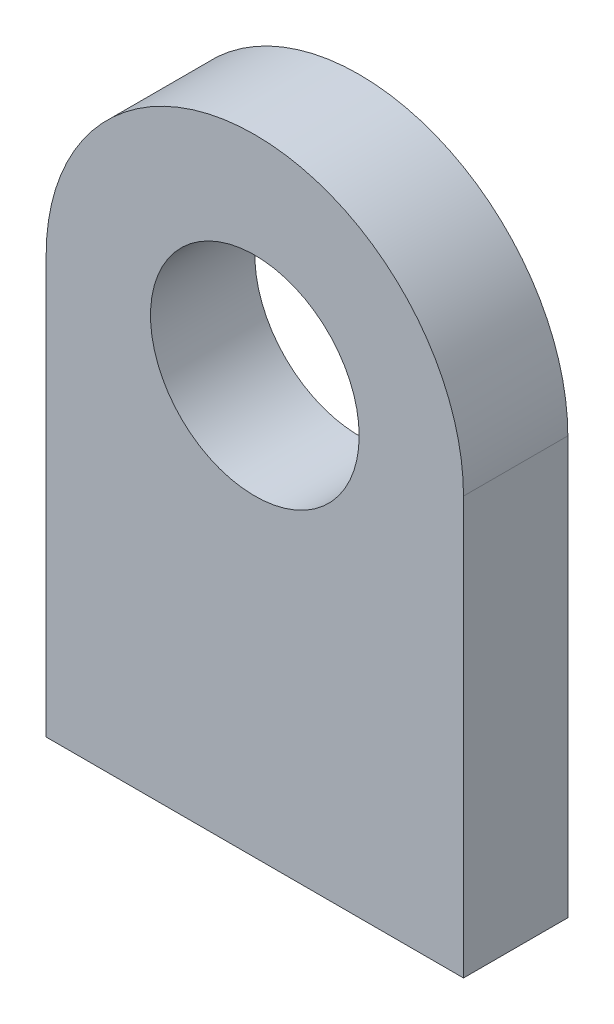
ISO-10303-21;
HEADER;
FILE_DESCRIPTION(('STEP AP214'),'2;1');
FILE_NAME('part.step','',(''),(''),'','','');
FILE_SCHEMA(('AUTOMOTIVE_DESIGN { 1 0 10303 214 1 1 1 1 }'));
ENDSEC;
DATA;
#1=APPLICATION_CONTEXT('core data for automotive mechanical design processes');
#2=APPLICATION_PROTOCOL_DEFINITION('international standard','automotive_design',2000,#1);
#3=PRODUCT_CONTEXT('',#1,'mechanical');
#4=PRODUCT('Part','Part','',(#3));
#5=PRODUCT_RELATED_PRODUCT_CATEGORY('part','',(#4));
#6=PRODUCT_DEFINITION_FORMATION('','',#4);
#7=PRODUCT_DEFINITION_CONTEXT('part definition',#1,'design');
#8=PRODUCT_DEFINITION('design','',#6,#7);
#9=PRODUCT_DEFINITION_SHAPE('','',#8);
#10=(LENGTH_UNIT() NAMED_UNIT(*) SI_UNIT(.MILLI.,.METRE.));
#11=(NAMED_UNIT(*) PLANE_ANGLE_UNIT() SI_UNIT($,.RADIAN.));
#12=(NAMED_UNIT(*) SI_UNIT($,.STERADIAN.) SOLID_ANGLE_UNIT());
#13=UNCERTAINTY_MEASURE_WITH_UNIT(LENGTH_MEASURE(1.E-05),#10,'distance_accuracy_value','');
#14=(GEOMETRIC_REPRESENTATION_CONTEXT(3) GLOBAL_UNCERTAINTY_ASSIGNED_CONTEXT((#13)) GLOBAL_UNIT_ASSIGNED_CONTEXT((#10,
#11,#12)) REPRESENTATION_CONTEXT('',''));
#15=CARTESIAN_POINT('',(0.,0.,0.));
#16=DIRECTION('',(0.,0.,1.));
#17=DIRECTION('',(1.,0.,0.));
#18=AXIS2_PLACEMENT_3D('',#15,#16,#17);
#19=CARTESIAN_POINT('',(0.,6.35,3.175));
#20=DIRECTION('',(0.,0.,-1.));
#21=DIRECTION('',(-1.,0.,0.));
#22=AXIS2_PLACEMENT_3D('',#19,#20,#21);
#23=PLANE('',#22);
#24=CARTESIAN_POINT('',(0.,6.35,3.175));
#25=DIRECTION('',(0.,0.,1.));
#26=DIRECTION('',(-1.,0.,0.));
#27=AXIS2_PLACEMENT_3D('',#24,#25,#26);
#28=CIRCLE('',#27,6.35);
#29=CARTESIAN_POINT('',(6.35,6.35,3.175));
#30=VERTEX_POINT('',#29);
#31=CARTESIAN_POINT('',(-6.35,6.35,3.175));
#32=VERTEX_POINT('',#31);
#33=EDGE_CURVE('E85',#30,#32,#28,.T.);
#34=ORIENTED_EDGE('',*,*,#33,.T.);
#35=DIRECTION('',(0.,-1.,0.));
#36=VECTOR('',#35,1.);
#37=CARTESIAN_POINT('',(-6.35,-6.35,3.175));
#38=LINE('',#37,#36);
#39=CARTESIAN_POINT('',(-6.35,-6.35,3.175));
#40=VERTEX_POINT('',#39);
#41=EDGE_CURVE('E80',#32,#40,#38,.T.);
#42=ORIENTED_EDGE('',*,*,#41,.T.);
#43=DIRECTION('',(1.,0.,0.));
#44=VECTOR('',#43,1.);
#45=CARTESIAN_POINT('',(6.35,-6.35,3.175));
#46=LINE('',#45,#44);
#47=CARTESIAN_POINT('',(6.35,-6.35,3.175));
#48=VERTEX_POINT('',#47);
#49=EDGE_CURVE('E83',#40,#48,#46,.T.);
#50=ORIENTED_EDGE('',*,*,#49,.T.);
#51=DIRECTION('',(0.,1.,0.));
#52=VECTOR('',#51,1.);
#53=CARTESIAN_POINT('',(6.35,-6.35,3.175));
#54=LINE('',#53,#52);
#55=EDGE_CURVE('E50',#48,#30,#54,.T.);
#56=ORIENTED_EDGE('',*,*,#55,.T.);
#57=EDGE_LOOP('',(#34,#42,#50,#56));
#58=FACE_BOUND('',#57,.T.);
#59=CARTESIAN_POINT('',(0.,6.35,3.175));
#60=DIRECTION('',(0.,0.,1.));
#61=DIRECTION('',(1.,0.,0.));
#62=AXIS2_PLACEMENT_3D('',#59,#60,#61);
#63=CIRCLE('',#62,3.175);
#64=CARTESIAN_POINT('',(3.175,6.35,3.175));
#65=VERTEX_POINT('',#64);
#66=EDGE_CURVE('E100',#65,#65,#63,.T.);
#67=ORIENTED_EDGE('',*,*,#66,.F.);
#68=EDGE_LOOP('',(#67));
#69=FACE_BOUND('',#68,.T.);
#70=ADVANCED_FACE('F33',(#58,#69),#23,.F.);
#71=CARTESIAN_POINT('',(0.,6.35,0.));
#72=DIRECTION('',(0.,0.,-1.));
#73=DIRECTION('',(-1.,0.,0.));
#74=AXIS2_PLACEMENT_3D('',#71,#72,#73);
#75=PLANE('',#74);
#76=CARTESIAN_POINT('',(0.,6.35,0.));
#77=DIRECTION('',(0.,0.,1.));
#78=DIRECTION('',(-1.,0.,0.));
#79=AXIS2_PLACEMENT_3D('',#76,#77,#78);
#80=CIRCLE('',#79,6.35);
#81=CARTESIAN_POINT('',(6.35,6.35,0.));
#82=VERTEX_POINT('',#81);
#83=CARTESIAN_POINT('',(-6.35,6.35,0.));
#84=VERTEX_POINT('',#83);
#85=EDGE_CURVE('E97',#82,#84,#80,.T.);
#86=ORIENTED_EDGE('',*,*,#85,.F.);
#87=DIRECTION('',(0.,1.,0.));
#88=VECTOR('',#87,1.);
#89=CARTESIAN_POINT('',(6.35,-6.35,0.));
#90=LINE('',#89,#88);
#91=CARTESIAN_POINT('',(6.35,-6.35,0.));
#92=VERTEX_POINT('',#91);
#93=EDGE_CURVE('E73',#92,#82,#90,.T.);
#94=ORIENTED_EDGE('',*,*,#93,.F.);
#95=DIRECTION('',(1.,0.,0.));
#96=VECTOR('',#95,1.);
#97=CARTESIAN_POINT('',(6.35,-6.35,0.));
#98=LINE('',#97,#96);
#99=CARTESIAN_POINT('',(-6.35,-6.35,0.));
#100=VERTEX_POINT('',#99);
#101=EDGE_CURVE('E67',#100,#92,#98,.T.);
#102=ORIENTED_EDGE('',*,*,#101,.F.);
#103=DIRECTION('',(0.,-1.,0.));
#104=VECTOR('',#103,1.);
#105=CARTESIAN_POINT('',(-6.35,-6.35,0.));
#106=LINE('',#105,#104);
#107=EDGE_CURVE('E89',#84,#100,#106,.T.);
#108=ORIENTED_EDGE('',*,*,#107,.F.);
#109=EDGE_LOOP('',(#86,#94,#102,#108));
#110=FACE_BOUND('',#109,.T.);
#111=CARTESIAN_POINT('',(0.,6.35,0.));
#112=DIRECTION('',(0.,0.,1.));
#113=DIRECTION('',(1.,0.,0.));
#114=AXIS2_PLACEMENT_3D('',#111,#112,#113);
#115=CIRCLE('',#114,3.175);
#116=CARTESIAN_POINT('',(3.175,6.35,0.));
#117=VERTEX_POINT('',#116);
#118=EDGE_CURVE('E112',#117,#117,#115,.T.);
#119=ORIENTED_EDGE('',*,*,#118,.T.);
#120=EDGE_LOOP('',(#119));
#121=FACE_BOUND('',#120,.T.);
#122=ADVANCED_FACE('F108',(#110,#121),#75,.T.);
#123=CARTESIAN_POINT('',(0.,6.35,3.175));
#124=DIRECTION('',(0.,0.,-1.));
#125=DIRECTION('',(-1.,0.,0.));
#126=AXIS2_PLACEMENT_3D('',#123,#124,#125);
#127=CYLINDRICAL_SURFACE('',#126,6.35);
#128=ORIENTED_EDGE('',*,*,#85,.T.);
#129=DIRECTION('',(0.,0.,-1.));
#130=VECTOR('',#129,1.);
#131=CARTESIAN_POINT('',(-6.35,6.35,3.175));
#132=LINE('',#131,#130);
#133=EDGE_CURVE('E11',#32,#84,#132,.T.);
#134=ORIENTED_EDGE('',*,*,#133,.F.);
#135=ORIENTED_EDGE('',*,*,#33,.F.);
#136=DIRECTION('',(0.,0.,-1.));
#137=VECTOR('',#136,1.);
#138=CARTESIAN_POINT('',(6.35,6.35,3.175));
#139=LINE('',#138,#137);
#140=EDGE_CURVE('E93',#30,#82,#139,.T.);
#141=ORIENTED_EDGE('',*,*,#140,.T.);
#142=EDGE_LOOP('',(#128,#134,#135,#141));
#143=FACE_BOUND('',#142,.T.);
#144=ADVANCED_FACE('F35',(#143),#127,.T.);
#145=CARTESIAN_POINT('',(-6.35,-6.35,3.175));
#146=DIRECTION('',(1.,0.,0.));
#147=DIRECTION('',(0.,0.,-1.));
#148=AXIS2_PLACEMENT_3D('',#145,#146,#147);
#149=PLANE('',#148);
#150=ORIENTED_EDGE('',*,*,#107,.T.);
#151=DIRECTION('',(0.,0.,-1.));
#152=VECTOR('',#151,1.);
#153=CARTESIAN_POINT('',(-6.35,-6.35,3.175));
#154=LINE('',#153,#152);
#155=EDGE_CURVE('E42',#40,#100,#154,.T.);
#156=ORIENTED_EDGE('',*,*,#155,.F.);
#157=ORIENTED_EDGE('',*,*,#41,.F.);
#158=ORIENTED_EDGE('',*,*,#133,.T.);
#159=EDGE_LOOP('',(#150,#156,#157,#158));
#160=FACE_BOUND('',#159,.T.);
#161=ADVANCED_FACE('F88',(#160),#149,.F.);
#162=CARTESIAN_POINT('',(6.35,-6.35,3.175));
#163=DIRECTION('',(0.,1.,0.));
#164=DIRECTION('',(-1.,0.,0.));
#165=AXIS2_PLACEMENT_3D('',#162,#163,#164);
#166=PLANE('',#165);
#167=ORIENTED_EDGE('',*,*,#101,.T.);
#168=DIRECTION('',(0.,0.,-1.));
#169=VECTOR('',#168,1.);
#170=CARTESIAN_POINT('',(6.35,-6.35,3.175));
#171=LINE('',#170,#169);
#172=EDGE_CURVE('E90',#48,#92,#171,.T.);
#173=ORIENTED_EDGE('',*,*,#172,.F.);
#174=ORIENTED_EDGE('',*,*,#49,.F.);
#175=ORIENTED_EDGE('',*,*,#155,.T.);
#176=EDGE_LOOP('',(#167,#173,#174,#175));
#177=FACE_BOUND('',#176,.T.);
#178=ADVANCED_FACE('F91',(#177),#166,.F.);
#179=CARTESIAN_POINT('',(6.35,-6.35,3.175));
#180=DIRECTION('',(-1.,0.,0.));
#181=DIRECTION('',(0.,-1.,0.));
#182=AXIS2_PLACEMENT_3D('',#179,#180,#181);
#183=PLANE('',#182);
#184=ORIENTED_EDGE('',*,*,#93,.T.);
#185=ORIENTED_EDGE('',*,*,#140,.F.);
#186=ORIENTED_EDGE('',*,*,#55,.F.);
#187=ORIENTED_EDGE('',*,*,#172,.T.);
#188=EDGE_LOOP('',(#184,#185,#186,#187));
#189=FACE_BOUND('',#188,.T.);
#190=ADVANCED_FACE('F105',(#189),#183,.F.);
#191=CARTESIAN_POINT('',(0.,6.35,3.175));
#192=DIRECTION('',(0.,0.,-1.));
#193=DIRECTION('',(-1.,0.,0.));
#194=AXIS2_PLACEMENT_3D('',#191,#192,#193);
#195=CYLINDRICAL_SURFACE('',#194,3.175);
#196=ORIENTED_EDGE('',*,*,#66,.T.);
#197=EDGE_LOOP('',(#196));
#198=FACE_BOUND('',#197,.T.);
#199=ORIENTED_EDGE('',*,*,#118,.F.);
#200=EDGE_LOOP('',(#199));
#201=FACE_BOUND('',#200,.T.);
#202=ADVANCED_FACE('F118',(#198,#201),#195,.F.);
#203=CLOSED_SHELL('',(#70,#122,#144,#161,#178,#190,#202));
#204=MANIFOLD_SOLID_BREP('B2',#203);
#205=ADVANCED_BREP_SHAPE_REPRESENTATION('',(#18,#204),#14);
#206=SHAPE_DEFINITION_REPRESENTATION(#9,#205);
ENDSEC;
END-ISO-10303-21;
